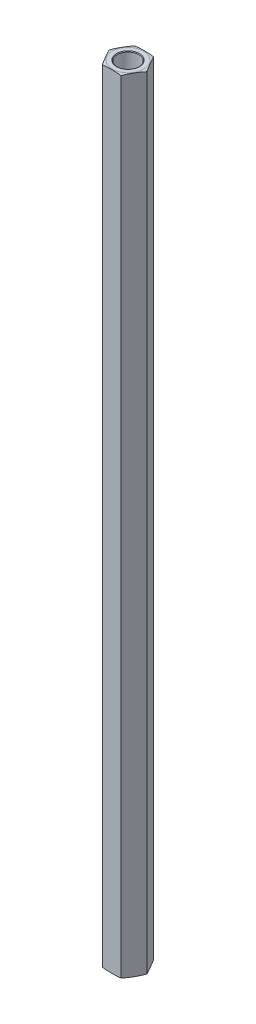
ISO-10303-21;
HEADER;
FILE_DESCRIPTION(('STEP AP214'),'2;1');
FILE_NAME('part.step','',(''),(''),'','','');
FILE_SCHEMA(('AUTOMOTIVE_DESIGN { 1 0 10303 214 1 1 1 1 }'));
ENDSEC;
DATA;
#1=APPLICATION_CONTEXT('core data for automotive mechanical design processes');
#2=APPLICATION_PROTOCOL_DEFINITION('international standard','automotive_design',2000,#1);
#3=PRODUCT_CONTEXT('',#1,'mechanical');
#4=PRODUCT('Part','Part','',(#3));
#5=PRODUCT_RELATED_PRODUCT_CATEGORY('part','',(#4));
#6=PRODUCT_DEFINITION_FORMATION('','',#4);
#7=PRODUCT_DEFINITION_CONTEXT('part definition',#1,'design');
#8=PRODUCT_DEFINITION('design','',#6,#7);
#9=PRODUCT_DEFINITION_SHAPE('','',#8);
#10=(LENGTH_UNIT() NAMED_UNIT(*) SI_UNIT(.MILLI.,.METRE.));
#11=(NAMED_UNIT(*) PLANE_ANGLE_UNIT() SI_UNIT($,.RADIAN.));
#12=(NAMED_UNIT(*) SI_UNIT($,.STERADIAN.) SOLID_ANGLE_UNIT());
#13=UNCERTAINTY_MEASURE_WITH_UNIT(LENGTH_MEASURE(1.E-05),#10,'distance_accuracy_value','');
#14=(GEOMETRIC_REPRESENTATION_CONTEXT(3) GLOBAL_UNCERTAINTY_ASSIGNED_CONTEXT((#13)) GLOBAL_UNIT_ASSIGNED_CONTEXT((#10,
#11,#12)) REPRESENTATION_CONTEXT('',''));
#15=CARTESIAN_POINT('',(0.,0.,0.));
#16=DIRECTION('',(0.,0.,1.));
#17=DIRECTION('',(1.,0.,0.));
#18=AXIS2_PLACEMENT_3D('',#15,#16,#17);
#19=CARTESIAN_POINT('',(0.,63.5,0.));
#20=DIRECTION('',(0.,1.,0.));
#21=DIRECTION('',(0.,0.,1.));
#22=AXIS2_PLACEMENT_3D('',#19,#20,#21);
#23=PLANE('',#22);
#24=CARTESIAN_POINT('',(0.,63.5,0.));
#25=DIRECTION('',(0.,1.,0.));
#26=DIRECTION('',(0.,0.,1.));
#27=AXIS2_PLACEMENT_3D('',#24,#25,#26);
#28=CIRCLE('',#27,2.0955);
#29=CARTESIAN_POINT('',(0.,63.5,2.0955));
#30=VERTEX_POINT('',#29);
#31=EDGE_CURVE('E302',#30,#30,#28,.T.);
#32=ORIENTED_EDGE('',*,*,#31,.T.);
#33=EDGE_LOOP('',(#32));
#34=FACE_BOUND('',#33,.T.);
#35=ADVANCED_FACE('F16',(#34),#23,.T.);
#36=CARTESIAN_POINT('',(0.,-63.5,0.));
#37=DIRECTION('',(0.,-1.,0.));
#38=DIRECTION('',(0.,0.,-1.));
#39=AXIS2_PLACEMENT_3D('',#36,#37,#38);
#40=PLANE('',#39);
#41=CARTESIAN_POINT('',(0.,-63.5,0.));
#42=DIRECTION('',(0.,-1.,0.));
#43=DIRECTION('',(0.,0.,-1.));
#44=AXIS2_PLACEMENT_3D('',#41,#42,#43);
#45=CIRCLE('',#44,2.0955);
#46=CARTESIAN_POINT('',(0.,-63.5,-2.0955));
#47=VERTEX_POINT('',#46);
#48=EDGE_CURVE('E312',#47,#47,#45,.T.);
#49=ORIENTED_EDGE('',*,*,#48,.T.);
#50=EDGE_LOOP('',(#49));
#51=FACE_BOUND('',#50,.T.);
#52=ADVANCED_FACE('F413',(#51),#40,.T.);
#53=CARTESIAN_POINT('',(0.,63.5,0.));
#54=DIRECTION('',(0.,1.,0.));
#55=DIRECTION('',(0.,0.,1.));
#56=AXIS2_PLACEMENT_3D('',#53,#54,#55);
#57=CYLINDRICAL_SURFACE('',#56,2.0955);
#58=CARTESIAN_POINT('',(0.,76.0729999999512,0.));
#59=DIRECTION('',(0.,1.,0.));
#60=DIRECTION('',(0.,0.,1.));
#61=AXIS2_PLACEMENT_3D('',#58,#59,#60);
#62=CIRCLE('',#61,2.09549999993897);
#63=CARTESIAN_POINT('',(0.,76.0729999999512,2.09549999993897));
#64=VERTEX_POINT('',#63);
#65=EDGE_CURVE('E314',#64,#64,#62,.T.);
#66=ORIENTED_EDGE('',*,*,#65,.T.);
#67=EDGE_LOOP('',(#66));
#68=FACE_BOUND('',#67,.T.);
#69=ORIENTED_EDGE('',*,*,#31,.F.);
#70=EDGE_LOOP('',(#69));
#71=FACE_BOUND('',#70,.T.);
#72=ADVANCED_FACE('F324',(#68,#71),#57,.F.);
#73=CARTESIAN_POINT('',(0.,-63.5,0.));
#74=DIRECTION('',(0.,-1.,0.));
#75=DIRECTION('',(0.,0.,-1.));
#76=AXIS2_PLACEMENT_3D('',#73,#74,#75);
#77=CYLINDRICAL_SURFACE('',#76,2.0955);
#78=ORIENTED_EDGE('',*,*,#48,.F.);
#79=EDGE_LOOP('',(#78));
#80=FACE_BOUND('',#79,.T.);
#81=CARTESIAN_POINT('',(0.,-76.0729999999512,0.));
#82=DIRECTION('',(0.,-1.,0.));
#83=DIRECTION('',(0.,0.,-1.));
#84=AXIS2_PLACEMENT_3D('',#81,#82,#83);
#85=CIRCLE('',#84,2.09550000005265);
#86=CARTESIAN_POINT('',(0.,-76.0729999999512,-2.09550000005265));
#87=VERTEX_POINT('',#86);
#88=EDGE_CURVE('E154',#87,#87,#85,.T.);
#89=ORIENTED_EDGE('',*,*,#88,.T.);
#90=EDGE_LOOP('',(#89));
#91=FACE_BOUND('',#90,.T.);
#92=ADVANCED_FACE('F329',(#80,#91),#77,.F.);
#93=CARTESIAN_POINT('',(0.,76.1999999999716,0.));
#94=DIRECTION('',(0.,1.,0.));
#95=DIRECTION('',(0.,0.,1.));
#96=AXIS2_PLACEMENT_3D('',#93,#94,#95);
#97=CONICAL_SURFACE('',#96,2.22249999995938,0.785398163397448);
#98=CARTESIAN_POINT('',(0.,76.2000000000285,0.));
#99=DIRECTION('',(0.,1.,0.));
#100=DIRECTION('',(0.,0.,1.));
#101=AXIS2_PLACEMENT_3D('',#98,#99,#100);
#102=CIRCLE('',#101,2.22250000001623);
#103=CARTESIAN_POINT('',(0.,76.2000000000285,2.22250000001623));
#104=VERTEX_POINT('',#103);
#105=EDGE_CURVE('E79',#104,#104,#102,.T.);
#106=ORIENTED_EDGE('',*,*,#105,.T.);
#107=EDGE_LOOP('',(#106));
#108=FACE_BOUND('',#107,.T.);
#109=ORIENTED_EDGE('',*,*,#65,.F.);
#110=EDGE_LOOP('',(#109));
#111=FACE_BOUND('',#110,.T.);
#112=ADVANCED_FACE('F327',(#108,#111),#97,.F.);
#113=CARTESIAN_POINT('',(-3.66617420935413,76.2,0.));
#114=DIRECTION('',(0.866025403784439,0.,-0.499999999999999));
#115=DIRECTION('',(-0.499999999999999,0.,-0.866025403784439));
#116=AXIS2_PLACEMENT_3D('',#113,#114,#115);
#117=PLANE('',#116);
#118=DIRECTION('',(0.,1.,0.));
#119=VECTOR('',#118,1.);
#120=CARTESIAN_POINT('',(-1.83308710467708,76.2,3.175));
#121=LINE('',#120,#119);
#122=CARTESIAN_POINT('',(-1.83308710467708,-76.073,3.17499999999999));
#123=VERTEX_POINT('',#122);
#124=CARTESIAN_POINT('',(-1.83308710467706,76.073,3.175));
#125=VERTEX_POINT('',#124);
#126=EDGE_CURVE('E75',#123,#125,#121,.T.);
#127=ORIENTED_EDGE('',*,*,#126,.T.);
#128=CARTESIAN_POINT('',(-3.66617420935412,76.073,0.));
#129=CARTESIAN_POINT('',(-3.62797961467393,76.0889014148997,0.0661549785605975));
#130=CARTESIAN_POINT('',(-3.58956810864153,76.1024886076105,0.132685658603946));
#131=CARTESIAN_POINT('',(-3.51249051795704,76.1258161979402,0.266187961794493));
#132=CARTESIAN_POINT('',(-3.47382473049837,76.1355604771397,0.333159070187556));
#133=CARTESIAN_POINT('',(-3.3964163186786,76.1519966530451,0.467234372392611));
#134=CARTESIAN_POINT('',(-3.35767399633298,76.1586945328669,0.534338043098447));
#135=CARTESIAN_POINT('',(-3.28009834620095,76.1697767572932,0.668703010557309));
#136=CARTESIAN_POINT('',(-3.24126499587751,76.1741604504739,0.735964346345629));
#137=CARTESIAN_POINT('',(-3.16354065964291,76.1812403004263,0.870586845688525));
#138=CARTESIAN_POINT('',(-3.1246496537445,76.1839355237591,0.937948043862028));
#139=CARTESIAN_POINT('',(-3.04685144594563,76.1881531983713,1.07269849250747));
#140=CARTESIAN_POINT('',(-3.00794424351938,76.1896756080272,1.14008774389011));
#141=CARTESIAN_POINT('',(-2.93051517598838,76.191922705889,1.27419882283648));
#142=CARTESIAN_POINT('',(-2.89199336248897,76.1926552468181,1.34092056101714));
#143=CARTESIAN_POINT('',(-2.81494778346103,76.1935767302574,1.47436741839211));
#144=CARTESIAN_POINT('',(-2.77642401791397,76.1937656658949,1.54109253761849));
#145=CARTESIAN_POINT('',(-2.69935964430966,76.1936659966805,1.67457194815462));
#146=CARTESIAN_POINT('',(-2.66081903631773,76.1933771811765,1.74132623935123));
#147=CARTESIAN_POINT('',(-2.58373908085278,76.192221986219,1.87483263846168));
#148=CARTESIAN_POINT('',(-2.54519973341192,76.1913555970385,1.9415847463198));
#149=CARTESIAN_POINT('',(-2.46812969629714,76.1887861940656,2.07507396634382));
#150=CARTESIAN_POINT('',(-2.42959900625906,76.1870832271616,2.14181107914046));
#151=CARTESIAN_POINT('',(-2.35255651340846,76.1824387229725,2.27525259109946));
#152=CARTESIAN_POINT('',(-2.31404470975378,76.1794972471357,2.34195699172048));
#153=CARTESIAN_POINT('',(-2.25084206239882,76.1732174124748,2.45142718811213));
#154=CARTESIAN_POINT('',(-2.22613849336951,76.1703980110462,2.49421502479918));
#155=CARTESIAN_POINT('',(-2.17676945272177,76.1638696794303,2.57972471152201));
#156=CARTESIAN_POINT('',(-2.15210397034136,76.1601610809138,2.62244658019807));
#157=CARTESIAN_POINT('',(-2.10282753811656,76.1516802711496,2.70779586442715));
#158=CARTESIAN_POINT('',(-2.07821657107493,76.1469084657008,2.75042330976666));
#159=CARTESIAN_POINT('',(-2.02900094683521,76.1360987712515,2.83566727147607));
#160=CARTESIAN_POINT('',(-2.00439646085438,76.1300577313084,2.87828349128898));
#161=CARTESIAN_POINT('',(-1.95527325900916,76.1165138354161,2.96336737271537));
#162=CARTESIAN_POINT('',(-1.930754596176,76.1090101978029,3.00583494247605));
#163=CARTESIAN_POINT('',(-1.88182157373165,76.0923203507084,3.09058942351758));
#164=CARTESIAN_POINT('',(-1.85740744053267,76.0831314978033,3.13287594264096));
#165=CARTESIAN_POINT('',(-1.83308710467707,76.073,3.175));
#166=B_SPLINE_CURVE_WITH_KNOTS('',3,(#128,#129,#130,#131,#132,#133,#134,#135,#136,#137,#138,
#139,#140,#141,#142,#143,#144,#145,#146,#147,#148,#149,#150,#151,#152,#153,#154,#155,#156,#157,
#158,#159,#160,#161,#162,#163,#164,#165),.UNSPECIFIED.,.F.,.F.,(4,2,2,2,2,2,2,2,2,2,2,2,2,2,2,2,
2,2,4),(0.,0.233977307818051,0.467717675040913,0.700996973557829,0.934341903230191,
1.16781571967295,1.40129782179891,1.63243665809747,1.86357841666705,2.09482211846393,
2.32606971471605,2.55730435147518,2.78852751694545,2.93698369265197,3.08538458004561,
3.2337289233465,3.38244598546656,3.53124274626105,3.68027493713584),.UNSPECIFIED.);
#167=CARTESIAN_POINT('',(-3.66617420935413,76.073,0.));
#168=VERTEX_POINT('',#167);
#169=EDGE_CURVE('E68',#168,#125,#166,.T.);
#170=ORIENTED_EDGE('',*,*,#169,.F.);
#171=DIRECTION('',(0.,1.,0.));
#172=VECTOR('',#171,1.);
#173=CARTESIAN_POINT('',(-3.66617420935413,76.2,0.));
#174=LINE('',#173,#172);
#175=CARTESIAN_POINT('',(-3.66617420935413,-76.073,0.));
#176=VERTEX_POINT('',#175);
#177=EDGE_CURVE('E72',#168,#176,#174,.F.);
#178=ORIENTED_EDGE('',*,*,#177,.T.);
#179=CARTESIAN_POINT('',(-1.83308710467708,-76.073,3.17499999999999));
#180=CARTESIAN_POINT('',(-1.87128169935727,-76.0889014148997,3.1088450214394));
#181=CARTESIAN_POINT('',(-1.90969320538966,-76.1024886076105,3.04231434139605));
#182=CARTESIAN_POINT('',(-1.98677079607416,-76.1258161979402,2.9088120382055));
#183=CARTESIAN_POINT('',(-2.02543658353282,-76.1355604771397,2.84184092981244));
#184=CARTESIAN_POINT('',(-2.10284499535259,-76.1519966530451,2.70776562760738));
#185=CARTESIAN_POINT('',(-2.14158731769822,-76.1586945328669,2.64066195690155));
#186=CARTESIAN_POINT('',(-2.21916296783025,-76.1697767572932,2.50629698944268));
#187=CARTESIAN_POINT('',(-2.25799631815369,-76.1741604504739,2.43903565365436));
#188=CARTESIAN_POINT('',(-2.33572065438829,-76.1812403004263,2.30441315431147));
#189=CARTESIAN_POINT('',(-2.37461166028669,-76.1839355237591,2.23705195613796));
#190=CARTESIAN_POINT('',(-2.45240986808556,-76.1881531983713,2.10230150749252));
#191=CARTESIAN_POINT('',(-2.49131707051182,-76.1896756080272,2.03491225610988));
#192=CARTESIAN_POINT('',(-2.56874613804282,-76.191922705889,1.90080117716351));
#193=CARTESIAN_POINT('',(-2.60726795154222,-76.1926552468181,1.83407943898285));
#194=CARTESIAN_POINT('',(-2.68431353057017,-76.1935767302574,1.70063258160788));
#195=CARTESIAN_POINT('',(-2.72283729611723,-76.1937656658949,1.6339074623815));
#196=CARTESIAN_POINT('',(-2.79990166972153,-76.1936659966805,1.50042805184538));
#197=CARTESIAN_POINT('',(-2.83844227771346,-76.1933771811765,1.43367376064876));
#198=CARTESIAN_POINT('',(-2.91552223317841,-76.192221986219,1.30016736153832));
#199=CARTESIAN_POINT('',(-2.95406158061928,-76.1913555970385,1.23341525368019));
#200=CARTESIAN_POINT('',(-3.03113161773406,-76.1887861940656,1.09992603365617));
#201=CARTESIAN_POINT('',(-3.06966230777213,-76.1870832271616,1.03318892085954));
#202=CARTESIAN_POINT('',(-3.14670480062273,-76.1824387229725,0.899747408900532));
#203=CARTESIAN_POINT('',(-3.18521660427741,-76.1794972471357,0.833043008279515));
#204=CARTESIAN_POINT('',(-3.24841925163237,-76.1732174124748,0.723572811887864));
#205=CARTESIAN_POINT('',(-3.27312282066168,-76.1703980110462,0.680784975200813));
#206=CARTESIAN_POINT('',(-3.32249186130943,-76.1638696794303,0.595275288477983));
#207=CARTESIAN_POINT('',(-3.34715734368984,-76.1601610809138,0.552553419801923));
#208=CARTESIAN_POINT('',(-3.39643377591464,-76.1516802711496,0.467204135572843));
#209=CARTESIAN_POINT('',(-3.42104474295627,-76.1469084657008,0.424576690233332));
#210=CARTESIAN_POINT('',(-3.47026036719599,-76.1360987712515,0.33933272852392));
#211=CARTESIAN_POINT('',(-3.49486485317681,-76.1300577313083,0.296716508711013));
#212=CARTESIAN_POINT('',(-3.54398805502204,-76.1165138354161,0.211632627284621));
#213=CARTESIAN_POINT('',(-3.5685067178552,-76.1090101978029,0.169165057523944));
#214=CARTESIAN_POINT('',(-3.61743974029955,-76.0923203507084,0.0844105764824117));
#215=CARTESIAN_POINT('',(-3.64185387349853,-76.0831314978033,0.042124057359026));
#216=CARTESIAN_POINT('',(-3.66617420935413,-76.073,0.));
#217=B_SPLINE_CURVE_WITH_KNOTS('',3,(#179,#180,#181,#182,#183,#184,#185,#186,#187,#188,#189,
#190,#191,#192,#193,#194,#195,#196,#197,#198,#199,#200,#201,#202,#203,#204,#205,#206,#207,#208,
#209,#210,#211,#212,#213,#214,#215,#216),.UNSPECIFIED.,.F.,.F.,(4,2,2,2,2,2,2,2,2,2,2,2,2,2,2,2,
2,2,4),(0.,0.233977307818054,0.467717675040914,0.70099697355783,0.934341903230193,
1.16781571967295,1.40129782179891,1.63243665809747,1.86357841666705,2.09482211846393,
2.32606971471605,2.55730435147519,2.78852751694545,2.93698369265197,3.08538458004561,
3.2337289233465,3.38244598546656,3.53124274626106,3.68027493713584),.UNSPECIFIED.);
#218=EDGE_CURVE('E87',#123,#176,#217,.T.);
#219=ORIENTED_EDGE('',*,*,#218,.F.);
#220=EDGE_LOOP('',(#127,#170,#178,#219));
#221=FACE_BOUND('',#220,.T.);
#222=ADVANCED_FACE('F70',(#221),#117,.F.);
#223=CARTESIAN_POINT('',(0.,-76.1999999998579,0.));
#224=DIRECTION('',(0.,-1.,0.));
#225=DIRECTION('',(0.,0.,-1.));
#226=AXIS2_PLACEMENT_3D('',#223,#224,#225);
#227=CONICAL_SURFACE('',#226,2.22249999995938,0.785398163397448);
#228=ORIENTED_EDGE('',*,*,#88,.F.);
#229=EDGE_LOOP('',(#228));
#230=FACE_BOUND('',#229,.T.);
#231=CARTESIAN_POINT('',(0.,-76.1999999999716,0.));
#232=DIRECTION('',(0.,-1.,0.));
#233=DIRECTION('',(0.,0.,-1.));
#234=AXIS2_PLACEMENT_3D('',#231,#232,#233);
#235=CIRCLE('',#234,2.22250000007307);
#236=CARTESIAN_POINT('',(0.,-76.1999999999716,-2.22250000007307));
#237=VERTEX_POINT('',#236);
#238=EDGE_CURVE('E278',#237,#237,#235,.F.);
#239=ORIENTED_EDGE('',*,*,#238,.F.);
#240=EDGE_LOOP('',(#239));
#241=FACE_BOUND('',#240,.T.);
#242=ADVANCED_FACE('F336',(#230,#241),#227,.F.);
#243=CARTESIAN_POINT('',(-1.83308710467707,76.2,-3.175));
#244=DIRECTION('',(0.,-1.,0.));
#245=DIRECTION('',(0.,0.,-1.));
#246=AXIS2_PLACEMENT_3D('',#243,#244,#245);
#247=PLANE('',#246);
#248=CARTESIAN_POINT('',(0.,76.2,0.));
#249=DIRECTION('',(0.,-1.,0.));
#250=DIRECTION('',(0.,0.,1.));
#251=AXIS2_PLACEMENT_3D('',#248,#249,#250);
#252=CIRCLE('',#251,3.03117420935412);
#253=CARTESIAN_POINT('',(0.,76.2,3.03117420935411));
#254=VERTEX_POINT('',#253);
#255=CARTESIAN_POINT('',(0.,76.2,-3.03117420935411));
#256=VERTEX_POINT('',#255);
#257=EDGE_CURVE('E78',#254,#256,#252,.T.);
#258=ORIENTED_EDGE('',*,*,#257,.F.);
#259=CARTESIAN_POINT('',(0.,76.2,0.));
#260=DIRECTION('',(0.,-1.,0.));
#261=DIRECTION('',(0.,0.,-1.));
#262=AXIS2_PLACEMENT_3D('',#259,#260,#261);
#263=CIRCLE('',#262,3.03117420935412);
#264=EDGE_CURVE('E139',#256,#254,#263,.T.);
#265=ORIENTED_EDGE('',*,*,#264,.F.);
#266=EDGE_LOOP('',(#258,#265));
#267=FACE_BOUND('',#266,.T.);
#268=ORIENTED_EDGE('',*,*,#105,.F.);
#269=EDGE_LOOP('',(#268));
#270=FACE_BOUND('',#269,.T.);
#271=ADVANCED_FACE('F115',(#267,#270),#247,.F.);
#272=CARTESIAN_POINT('',(-1.83308710467707,76.2,-3.175));
#273=DIRECTION('',(0.866025403784439,0.,0.5));
#274=DIRECTION('',(0.5,0.,-0.866025403784439));
#275=AXIS2_PLACEMENT_3D('',#272,#273,#274);
#276=PLANE('',#275);
#277=ORIENTED_EDGE('',*,*,#177,.F.);
#278=CARTESIAN_POINT('',(-1.83308710467706,76.073,-3.17500000000001));
#279=CARTESIAN_POINT('',(-1.87128169935725,76.0889014148997,-3.10884502143942));
#280=CARTESIAN_POINT('',(-1.90969320538965,76.1024886076105,-3.04231434139607));
#281=CARTESIAN_POINT('',(-1.98677079607414,76.1258161979402,-2.90881203820553));
#282=CARTESIAN_POINT('',(-2.0254365835328,76.1355604771397,-2.84184092981247));
#283=CARTESIAN_POINT('',(-2.10284499535257,76.1519966530451,-2.70776562760742));
#284=CARTESIAN_POINT('',(-2.1415873176982,76.1586945328669,-2.64066195690159));
#285=CARTESIAN_POINT('',(-2.21916296783022,76.1697767572932,-2.50629698944273));
#286=CARTESIAN_POINT('',(-2.25799631815366,76.1741604504739,-2.43903565365441));
#287=CARTESIAN_POINT('',(-2.33572065438826,76.1812403004263,-2.30441315431152));
#288=CARTESIAN_POINT('',(-2.37461166028667,76.1839355237591,-2.23705195613802));
#289=CARTESIAN_POINT('',(-2.45240986808553,76.1881531983713,-2.10230150749258));
#290=CARTESIAN_POINT('',(-2.49131707051179,76.1896756080272,-2.03491225610994));
#291=CARTESIAN_POINT('',(-2.56874613804278,76.191922705889,-1.90080117716357));
#292=CARTESIAN_POINT('',(-2.60726795154219,76.1926552468181,-1.83407943898291));
#293=CARTESIAN_POINT('',(-2.68431353057013,76.1935767302574,-1.70063258160795));
#294=CARTESIAN_POINT('',(-2.72283729611719,76.1937656658949,-1.63390746238157));
#295=CARTESIAN_POINT('',(-2.79990166972149,76.1936659966805,-1.50042805184545));
#296=CARTESIAN_POINT('',(-2.83844227771342,76.1933771811765,-1.43367376064884));
#297=CARTESIAN_POINT('',(-2.91552223317837,76.192221986219,-1.3001673615384));
#298=CARTESIAN_POINT('',(-2.95406158061923,76.1913555970385,-1.23341525368027));
#299=CARTESIAN_POINT('',(-3.03113161773401,76.1887861940656,-1.09992603365625));
#300=CARTESIAN_POINT('',(-3.06966230777209,76.1870832271616,-1.03318892085962));
#301=CARTESIAN_POINT('',(-3.14670480062269,76.1824387229725,-0.899747408900623));
#302=CARTESIAN_POINT('',(-3.18521660427736,76.1794972471357,-0.833043008279609));
#303=CARTESIAN_POINT('',(-3.24841925163232,76.1732174124748,-0.723572811887956));
#304=CARTESIAN_POINT('',(-3.27312282066164,76.1703980110462,-0.6807849752009));
#305=CARTESIAN_POINT('',(-3.32249186130939,76.1638696794303,-0.595275288478059));
#306=CARTESIAN_POINT('',(-3.3471573436898,76.1601610809138,-0.552553419801995));
#307=CARTESIAN_POINT('',(-3.39643377591461,76.1516802711496,-0.467204135572906));
#308=CARTESIAN_POINT('',(-3.42104474295624,76.1469084657008,-0.424576690233391));
#309=CARTESIAN_POINT('',(-3.47026036719597,76.1360987712515,-0.339332728523969));
#310=CARTESIAN_POINT('',(-3.49486485317679,76.1300577313084,-0.296716508711057));
#311=CARTESIAN_POINT('',(-3.54398805502203,76.1165138354161,-0.211632627284654));
#312=CARTESIAN_POINT('',(-3.56850671785518,76.1090101978029,-0.169165057523973));
#313=CARTESIAN_POINT('',(-3.61743974029955,76.0923203507084,-0.084410576482432));
#314=CARTESIAN_POINT('',(-3.64185387349853,76.0831314978033,-0.0421240573590423));
#315=CARTESIAN_POINT('',(-3.66617420935413,76.073,0.));
#316=B_SPLINE_CURVE_WITH_KNOTS('',3,(#278,#279,#280,#281,#282,#283,#284,#285,#286,#287,#288,
#289,#290,#291,#292,#293,#294,#295,#296,#297,#298,#299,#300,#301,#302,#303,#304,#305,#306,#307,
#308,#309,#310,#311,#312,#313,#314,#315),.UNSPECIFIED.,.F.,.F.,(4,2,2,2,2,2,2,2,2,2,2,2,2,2,2,2,
2,2,4),(0.,0.233977307818047,0.4677176750409,0.700996973557809,0.934341903230164,
1.16781571967292,1.40129782179887,1.63243665809742,1.863578416667,2.09482211846387,
2.32606971471598,2.55730435147511,2.78852751694536,2.9369836926519,3.08538458004556,
3.23372892334647,3.38244598546655,3.53124274626106,3.68027493713586),.UNSPECIFIED.);
#317=CARTESIAN_POINT('',(-1.83308710467705,76.073,-3.17500000000001));
#318=VERTEX_POINT('',#317);
#319=EDGE_CURVE('E84',#318,#168,#316,.T.);
#320=ORIENTED_EDGE('',*,*,#319,.F.);
#321=DIRECTION('',(0.,1.,0.));
#322=VECTOR('',#321,1.);
#323=CARTESIAN_POINT('',(-1.83308710467705,76.2,-3.175));
#324=LINE('',#323,#322);
#325=CARTESIAN_POINT('',(-1.83308710467708,-76.073,-3.175));
#326=VERTEX_POINT('',#325);
#327=EDGE_CURVE('E177',#318,#326,#324,.F.);
#328=ORIENTED_EDGE('',*,*,#327,.T.);
#329=CARTESIAN_POINT('',(-3.66617420935413,-76.073,0.));
#330=CARTESIAN_POINT('',(-3.62797961467394,-76.0889014148997,-0.0661549785605842));
#331=CARTESIAN_POINT('',(-3.58956810864155,-76.1024886076105,-0.132685658603931));
#332=CARTESIAN_POINT('',(-3.51249051795705,-76.1258161979402,-0.266187961794475));
#333=CARTESIAN_POINT('',(-3.47382473049839,-76.1355604771397,-0.333159070187536));
#334=CARTESIAN_POINT('',(-3.39641631867862,-76.1519966530451,-0.467234372392588));
#335=CARTESIAN_POINT('',(-3.357673996333,-76.1586945328669,-0.534338043098422));
#336=CARTESIAN_POINT('',(-3.28009834620097,-76.1697767572932,-0.668703010557281));
#337=CARTESIAN_POINT('',(-3.24126499587753,-76.1741604504739,-0.735964346345599));
#338=CARTESIAN_POINT('',(-3.16354065964293,-76.1812403004263,-0.870586845688492));
#339=CARTESIAN_POINT('',(-3.12464965374452,-76.1839355237591,-0.937948043861994));
#340=CARTESIAN_POINT('',(-3.04685144594566,-76.1881531983713,-1.07269849250743));
#341=CARTESIAN_POINT('',(-3.0079442435194,-76.1896756080272,-1.14008774389007));
#342=CARTESIAN_POINT('',(-2.93051517598841,-76.191922705889,-1.27419882283644));
#343=CARTESIAN_POINT('',(-2.891993362489,-76.1926552468181,-1.3409205610171));
#344=CARTESIAN_POINT('',(-2.81494778346106,-76.1935767302574,-1.47436741839206));
#345=CARTESIAN_POINT('',(-2.776424017914,-76.1937656658949,-1.54109253761844));
#346=CARTESIAN_POINT('',(-2.6993596443097,-76.1936659966805,-1.67457194815457));
#347=CARTESIAN_POINT('',(-2.66081903631777,-76.1933771811765,-1.74132623935118));
#348=CARTESIAN_POINT('',(-2.58373908085282,-76.192221986219,-1.87483263846162));
#349=CARTESIAN_POINT('',(-2.54519973341195,-76.1913555970385,-1.94158474631974));
#350=CARTESIAN_POINT('',(-2.46812969629717,-76.1887861940656,-2.07507396634376));
#351=CARTESIAN_POINT('',(-2.4295990062591,-76.1870832271616,-2.14181107914039));
#352=CARTESIAN_POINT('',(-2.3525565134085,-76.1824387229725,-2.27525259109939));
#353=CARTESIAN_POINT('',(-2.31404470975383,-76.1794972471357,-2.34195699172041));
#354=CARTESIAN_POINT('',(-2.25084206239887,-76.1732174124748,-2.45142718811206));
#355=CARTESIAN_POINT('',(-2.22613849336955,-76.1703980110462,-2.49421502479912));
#356=CARTESIAN_POINT('',(-2.1767694527218,-76.1638696794303,-2.57972471152195));
#357=CARTESIAN_POINT('',(-2.15210397034139,-76.1601610809138,-2.62244658019802));
#358=CARTESIAN_POINT('',(-2.10282753811659,-76.1516802711496,-2.7077958644271));
#359=CARTESIAN_POINT('',(-2.07821657107495,-76.1469084657008,-2.75042330976661));
#360=CARTESIAN_POINT('',(-2.02900094683523,-76.1360987712515,-2.83566727147603));
#361=CARTESIAN_POINT('',(-2.0043964608544,-76.1300577313084,-2.87828349128894));
#362=CARTESIAN_POINT('',(-1.95527325900917,-76.1165138354161,-2.96336737271534));
#363=CARTESIAN_POINT('',(-1.93075459617602,-76.1090101978029,-3.00583494247602));
#364=CARTESIAN_POINT('',(-1.88182157373166,-76.0923203507084,-3.09058942351756));
#365=CARTESIAN_POINT('',(-1.85740744053268,-76.0831314978033,-3.13287594264095));
#366=CARTESIAN_POINT('',(-1.83308710467707,-76.073,-3.17499999999999));
#367=B_SPLINE_CURVE_WITH_KNOTS('',3,(#329,#330,#331,#332,#333,#334,#335,#336,#337,#338,#339,
#340,#341,#342,#343,#344,#345,#346,#347,#348,#349,#350,#351,#352,#353,#354,#355,#356,#357,#358,
#359,#360,#361,#362,#363,#364,#365,#366),.UNSPECIFIED.,.F.,.F.,(4,2,2,2,2,2,2,2,2,2,2,2,2,2,2,2,
2,2,4),(0.,0.233977307818045,0.467717675040901,0.700996973557812,0.934341903230169,
1.16781571967292,1.40129782179888,1.63243665809743,1.86357841666701,2.09482211846388,
2.32606971471599,2.55730435147512,2.78852751694538,2.93698369265191,3.08538458004557,
3.23372892334647,3.38244598546654,3.53124274626104,3.68027493713584),.UNSPECIFIED.);
#368=EDGE_CURVE('E86',#176,#326,#367,.T.);
#369=ORIENTED_EDGE('',*,*,#368,.F.);
#370=EDGE_LOOP('',(#277,#320,#328,#369));
#371=FACE_BOUND('',#370,.T.);
#372=ADVANCED_FACE('F82',(#371),#276,.F.);
#373=CARTESIAN_POINT('',(-1.83308710467707,76.2,3.175));
#374=DIRECTION('',(0.,0.,-1.));
#375=DIRECTION('',(-1.,0.,0.));
#376=AXIS2_PLACEMENT_3D('',#373,#374,#375);
#377=PLANE('',#376);
#378=DIRECTION('',(0.,1.,0.));
#379=VECTOR('',#378,1.);
#380=CARTESIAN_POINT('',(1.83308710467706,76.2,3.17499999999999));
#381=LINE('',#380,#379);
#382=CARTESIAN_POINT('',(1.83308710467706,-76.073,3.17499999999999));
#383=VERTEX_POINT('',#382);
#384=CARTESIAN_POINT('',(1.83308710467706,76.073,3.17499999999999));
#385=VERTEX_POINT('',#384);
#386=EDGE_CURVE('E179',#383,#385,#381,.T.);
#387=ORIENTED_EDGE('',*,*,#386,.T.);
#388=CARTESIAN_POINT('',(-1.83308710467706,76.073,3.175));
#389=CARTESIAN_POINT('',(-1.73237579828683,76.0939400141518,3.175));
#390=CARTESIAN_POINT('',(-1.63096506893486,76.1108853495327,3.175));
#391=CARTESIAN_POINT('',(-1.42767146651469,76.1384971643984,3.175));
#392=CARTESIAN_POINT('',(-1.32579191427254,76.1491875658753,3.175));
#393=CARTESIAN_POINT('',(-1.12177634709138,76.1661280408079,3.175));
#394=CARTESIAN_POINT('',(-1.0196405664338,76.1723812707188,3.175));
#395=CARTESIAN_POINT('',(-0.815663681397375,76.1819028064183,3.175));
#396=CARTESIAN_POINT('',(-0.713823115514573,76.1851834044999,3.175));
#397=CARTESIAN_POINT('',(-0.510018485441651,76.1899454848703,3.175));
#398=CARTESIAN_POINT('',(-0.408054390577976,76.1914254100882,3.175));
#399=CARTESIAN_POINT('',(-0.20406020033787,76.1933146818379,3.175));
#400=CARTESIAN_POINT('',(-0.102030100168935,76.1937234241492,3.175));
#401=CARTESIAN_POINT('',(0.102030100168935,76.1937234241492,3.175));
#402=CARTESIAN_POINT('',(0.20406020033787,76.1933146818379,3.175));
#403=CARTESIAN_POINT('',(0.408054390577977,76.1914254100882,3.17499999999999));
#404=CARTESIAN_POINT('',(0.510018485441652,76.1899454848703,3.17499999999999));
#405=CARTESIAN_POINT('',(0.713823115514574,76.1851834044999,3.17499999999999));
#406=CARTESIAN_POINT('',(0.815663681397377,76.1819028064183,3.17499999999999));
#407=CARTESIAN_POINT('',(1.0196405664338,76.1723812707188,3.17499999999999));
#408=CARTESIAN_POINT('',(1.12177634709138,76.1661280408079,3.17499999999999));
#409=CARTESIAN_POINT('',(1.32579191427254,76.1491875658753,3.17499999999999));
#410=CARTESIAN_POINT('',(1.42767146651469,76.1384971643984,3.17499999999999));
#411=CARTESIAN_POINT('',(1.63096506893486,76.1108853495327,3.17499999999999));
#412=CARTESIAN_POINT('',(1.73237579828684,76.0939400141518,3.17499999999999));
#413=CARTESIAN_POINT('',(1.83308710467706,76.073,3.17499999999999));
#414=B_SPLINE_CURVE_WITH_KNOTS('',3,(#388,#389,#390,#391,#392,#393,#394,#395,#396,#397,#398,
#399,#400,#401,#402,#403,#404,#405,#406,#407,#408,#409,#410,#411,#412,#413),.UNSPECIFIED.,.F.,
.F.,(4,2,2,2,2,2,2,2,2,2,2,2,4),(0.,0.308333242342805,0.615479423308232,0.922406891130007,
1.2280592962085,1.53397581645216,1.84006485747889,2.14615389850561,2.45207041874927,
2.75772282382777,3.06465029164954,3.37179647261497,3.68012971495778),.UNSPECIFIED.);
#415=EDGE_CURVE('E273',#125,#385,#414,.T.);
#416=ORIENTED_EDGE('',*,*,#415,.F.);
#417=ORIENTED_EDGE('',*,*,#126,.F.);
#418=CARTESIAN_POINT('',(1.83308710467706,-76.073,3.17499999999999));
#419=CARTESIAN_POINT('',(1.73237579828684,-76.0939400141518,3.17499999999999));
#420=CARTESIAN_POINT('',(1.63096506893486,-76.1108853495327,3.17499999999999));
#421=CARTESIAN_POINT('',(1.4276714665147,-76.1384971643984,3.17499999999999));
#422=CARTESIAN_POINT('',(1.32579191427254,-76.1491875658753,3.17499999999999));
#423=CARTESIAN_POINT('',(1.12177634709138,-76.1661280408079,3.17499999999999));
#424=CARTESIAN_POINT('',(1.0196405664338,-76.1723812707188,3.17499999999999));
#425=CARTESIAN_POINT('',(0.815663681397376,-76.1819028064183,3.17499999999999));
#426=CARTESIAN_POINT('',(0.713823115514574,-76.1851834044999,3.17499999999999));
#427=CARTESIAN_POINT('',(0.510018485441651,-76.1899454848703,3.17499999999999));
#428=CARTESIAN_POINT('',(0.408054390577975,-76.1914254100882,3.175));
#429=CARTESIAN_POINT('',(0.204060200337868,-76.1933146818379,3.17499999999999));
#430=CARTESIAN_POINT('',(0.102030100168933,-76.1937234241492,3.17499999999999));
#431=CARTESIAN_POINT('',(-0.102030100168939,-76.1937234241492,3.17499999999999));
#432=CARTESIAN_POINT('',(-0.204060200337874,-76.1933146818379,3.175));
#433=CARTESIAN_POINT('',(-0.408054390577982,-76.1914254100882,3.175));
#434=CARTESIAN_POINT('',(-0.510018485441658,-76.1899454848703,3.175));
#435=CARTESIAN_POINT('',(-0.713823115514581,-76.1851834044999,3.175));
#436=CARTESIAN_POINT('',(-0.815663681397385,-76.1819028064183,3.175));
#437=CARTESIAN_POINT('',(-1.01964056643381,-76.1723812707188,3.175));
#438=CARTESIAN_POINT('',(-1.12177634709139,-76.1661280408079,3.175));
#439=CARTESIAN_POINT('',(-1.32579191427255,-76.1491875658753,3.175));
#440=CARTESIAN_POINT('',(-1.42767146651471,-76.1384971643984,3.175));
#441=CARTESIAN_POINT('',(-1.63096506893487,-76.1108853495327,3.175));
#442=CARTESIAN_POINT('',(-1.73237579828685,-76.0939400141518,3.175));
#443=CARTESIAN_POINT('',(-1.83308710467708,-76.073,3.175));
#444=B_SPLINE_CURVE_WITH_KNOTS('',3,(#418,#419,#420,#421,#422,#423,#424,#425,#426,#427,#428,
#429,#430,#431,#432,#433,#434,#435,#436,#437,#438,#439,#440,#441,#442,#443),.UNSPECIFIED.,.F.,
.F.,(4,2,2,2,2,2,2,2,2,2,2,2,4),(0.,0.308333242342807,0.615479423308235,0.922406891130011,
1.2280592962085,1.53397581645217,1.84006485747889,2.14615389850562,2.45207041874929,
2.75772282382778,3.06465029164956,3.37179647261499,3.6801297149578),.UNSPECIFIED.);
#445=EDGE_CURVE('E250',#383,#123,#444,.T.);
#446=ORIENTED_EDGE('',*,*,#445,.F.);
#447=EDGE_LOOP('',(#387,#416,#417,#446));
#448=FACE_BOUND('',#447,.T.);
#449=ADVANCED_FACE('F203',(#448),#377,.F.);
#450=CARTESIAN_POINT('',(-1.83308710467707,-76.2,-3.175));
#451=DIRECTION('',(0.,-1.,0.));
#452=DIRECTION('',(0.,0.,-1.));
#453=AXIS2_PLACEMENT_3D('',#450,#451,#452);
#454=PLANE('',#453);
#455=CARTESIAN_POINT('',(0.,-76.2,0.));
#456=DIRECTION('',(0.,1.,0.));
#457=DIRECTION('',(0.,0.,1.));
#458=AXIS2_PLACEMENT_3D('',#455,#456,#457);
#459=CIRCLE('',#458,3.03117420935408);
#460=CARTESIAN_POINT('',(0.,-76.2,3.0311742093541));
#461=VERTEX_POINT('',#460);
#462=CARTESIAN_POINT('',(0.,-76.2,-3.0311742093541));
#463=VERTEX_POINT('',#462);
#464=EDGE_CURVE('E189',#461,#463,#459,.T.);
#465=ORIENTED_EDGE('',*,*,#464,.F.);
#466=CARTESIAN_POINT('',(0.,-76.2,0.));
#467=DIRECTION('',(0.,1.,0.));
#468=DIRECTION('',(0.,0.,-1.));
#469=AXIS2_PLACEMENT_3D('',#466,#467,#468);
#470=CIRCLE('',#469,3.03117420935408);
#471=EDGE_CURVE('E182',#461,#463,#470,.F.);
#472=ORIENTED_EDGE('',*,*,#471,.T.);
#473=EDGE_LOOP('',(#465,#472));
#474=FACE_BOUND('',#473,.T.);
#475=ORIENTED_EDGE('',*,*,#238,.T.);
#476=EDGE_LOOP('',(#475));
#477=FACE_BOUND('',#476,.T.);
#478=ADVANCED_FACE('F194',(#474,#477),#454,.T.);
#479=CARTESIAN_POINT('',(1.83308710467706,76.2,3.17499999999999));
#480=DIRECTION('',(-0.866025403784439,0.,-0.5));
#481=DIRECTION('',(-0.5,0.,0.866025403784439));
#482=AXIS2_PLACEMENT_3D('',#479,#480,#481);
#483=PLANE('',#482);
#484=DIRECTION('',(0.,1.,0.));
#485=VECTOR('',#484,1.);
#486=CARTESIAN_POINT('',(3.66617420935412,76.2,0.));
#487=LINE('',#486,#485);
#488=CARTESIAN_POINT('',(3.66617420935412,-76.073,0.));
#489=VERTEX_POINT('',#488);
#490=CARTESIAN_POINT('',(3.66617420935412,76.073,0.));
#491=VERTEX_POINT('',#490);
#492=EDGE_CURVE('E235',#489,#491,#487,.T.);
#493=ORIENTED_EDGE('',*,*,#492,.T.);
#494=CARTESIAN_POINT('',(1.83308710467706,76.073,3.17499999999999));
#495=CARTESIAN_POINT('',(1.87128169935726,76.0889014148997,3.1088450214394));
#496=CARTESIAN_POINT('',(1.90969320538965,76.1024886076105,3.04231434139605));
#497=CARTESIAN_POINT('',(1.98677079607415,76.1258161979402,2.9088120382055));
#498=CARTESIAN_POINT('',(2.02543658353281,76.1355604771397,2.84184092981244));
#499=CARTESIAN_POINT('',(2.10284499535258,76.1519966530451,2.70776562760738));
#500=CARTESIAN_POINT('',(2.14158731769821,76.1586945328669,2.64066195690155));
#501=CARTESIAN_POINT('',(2.21916296783024,76.1697767572932,2.50629698944269));
#502=CARTESIAN_POINT('',(2.25799631815368,76.1741604504739,2.43903565365437));
#503=CARTESIAN_POINT('',(2.33572065438828,76.1812403004263,2.30441315431147));
#504=CARTESIAN_POINT('',(2.37461166028669,76.1839355237591,2.23705195613797));
#505=CARTESIAN_POINT('',(2.45240986808556,76.1881531983714,2.10230150749252));
#506=CARTESIAN_POINT('',(2.49131707051181,76.1896756080272,2.03491225610988));
#507=CARTESIAN_POINT('',(2.56874613804281,76.191922705889,1.90080117716351));
#508=CARTESIAN_POINT('',(2.60726795154221,76.1926552468181,1.83407943898285));
#509=CARTESIAN_POINT('',(2.68431353057016,76.1935767302574,1.70063258160788));
#510=CARTESIAN_POINT('',(2.72283729611722,76.1937656658949,1.6339074623815));
#511=CARTESIAN_POINT('',(2.79990166972153,76.1936659966805,1.50042805184538));
#512=CARTESIAN_POINT('',(2.83844227771346,76.1933771811765,1.43367376064876));
#513=CARTESIAN_POINT('',(2.91552223317841,76.192221986219,1.30016736153832));
#514=CARTESIAN_POINT('',(2.95406158061927,76.1913555970385,1.23341525368019));
#515=CARTESIAN_POINT('',(3.03113161773405,76.1887861940656,1.09992603365617));
#516=CARTESIAN_POINT('',(3.06966230777213,76.1870832271616,1.03318892085954));
#517=CARTESIAN_POINT('',(3.14670480062273,76.1824387229725,0.899747408900531));
#518=CARTESIAN_POINT('',(3.18521660427741,76.1794972471357,0.833043008279514));
#519=CARTESIAN_POINT('',(3.24841925163237,76.1732174124748,0.723572811887865));
#520=CARTESIAN_POINT('',(3.27312282066168,76.1703980110462,0.680784975200815));
#521=CARTESIAN_POINT('',(3.32249186130942,76.1638696794303,0.595275288477986));
#522=CARTESIAN_POINT('',(3.34715734368983,76.1601610809138,0.552553419801928));
#523=CARTESIAN_POINT('',(3.39643377591463,76.1516802711496,0.467204135572849));
#524=CARTESIAN_POINT('',(3.42104474295626,76.1469084657008,0.424576690233339));
#525=CARTESIAN_POINT('',(3.47026036719598,76.1360987712515,0.339332728523928));
#526=CARTESIAN_POINT('',(3.49486485317681,76.1300577313084,0.296716508711022));
#527=CARTESIAN_POINT('',(3.54398805502203,76.1165138354161,0.211632627284631));
#528=CARTESIAN_POINT('',(3.56850671785519,76.1090101978029,0.169165057523955));
#529=CARTESIAN_POINT('',(3.61743974029954,76.0923203507084,0.0844105764824248));
#530=CARTESIAN_POINT('',(3.64185387349852,76.0831314978033,0.0421240573590407));
#531=CARTESIAN_POINT('',(3.66617420935412,76.073,0.));
#532=B_SPLINE_CURVE_WITH_KNOTS('',3,(#494,#495,#496,#497,#498,#499,#500,#501,#502,#503,#504,
#505,#506,#507,#508,#509,#510,#511,#512,#513,#514,#515,#516,#517,#518,#519,#520,#521,#522,#523,
#524,#525,#526,#527,#528,#529,#530,#531),.UNSPECIFIED.,.F.,.F.,(4,2,2,2,2,2,2,2,2,2,2,2,2,2,2,2,
2,2,4),(0.,0.233977307818054,0.467717675040915,0.700996973557832,0.934341903230195,
1.16781571967295,1.40129782179892,1.63243665809748,1.86357841666706,2.09482211846394,
2.32606971471605,2.55730435147519,2.78852751694545,2.93698369265197,3.08538458004561,
3.2337289233465,3.38244598546656,3.53124274626105,3.68027493713583),.UNSPECIFIED.);
#533=EDGE_CURVE('E268',#385,#491,#532,.T.);
#534=ORIENTED_EDGE('',*,*,#533,.F.);
#535=ORIENTED_EDGE('',*,*,#386,.F.);
#536=CARTESIAN_POINT('',(3.66617420935412,-76.073,0.));
#537=CARTESIAN_POINT('',(3.62797961467393,-76.0889014148997,0.0661549785605952));
#538=CARTESIAN_POINT('',(3.58956810864153,-76.1024886076105,0.132685658603945));
#539=CARTESIAN_POINT('',(3.51249051795703,-76.1258161979402,0.266187961794492));
#540=CARTESIAN_POINT('',(3.47382473049837,-76.1355604771397,0.333159070187555));
#541=CARTESIAN_POINT('',(3.3964163186786,-76.1519966530451,0.467234372392611));
#542=CARTESIAN_POINT('',(3.35767399633297,-76.1586945328669,0.534338043098447));
#543=CARTESIAN_POINT('',(3.28009834620094,-76.1697767572932,0.66870301055731));
#544=CARTESIAN_POINT('',(3.2412649958775,-76.1741604504739,0.735964346345631));
#545=CARTESIAN_POINT('',(3.1635406596429,-76.1812403004263,0.870586845688526));
#546=CARTESIAN_POINT('',(3.12464965374449,-76.1839355237591,0.93794804386203));
#547=CARTESIAN_POINT('',(3.04685144594563,-76.1881531983714,1.07269849250747));
#548=CARTESIAN_POINT('',(3.00794424351937,-76.1896756080272,1.14008774389011));
#549=CARTESIAN_POINT('',(2.93051517598837,-76.191922705889,1.27419882283648));
#550=CARTESIAN_POINT('',(2.89199336248897,-76.1926552468181,1.34092056101715));
#551=CARTESIAN_POINT('',(2.81494778346102,-76.1935767302574,1.47436741839211));
#552=CARTESIAN_POINT('',(2.77642401791396,-76.1937656658949,1.5410925376185));
#553=CARTESIAN_POINT('',(2.69935964430965,-76.1936659966805,1.67457194815462));
#554=CARTESIAN_POINT('',(2.66081903631772,-76.1933771811765,1.74132623935124));
#555=CARTESIAN_POINT('',(2.58373908085277,-76.192221986219,1.87483263846168));
#556=CARTESIAN_POINT('',(2.54519973341191,-76.1913555970385,1.94158474631981));
#557=CARTESIAN_POINT('',(2.46812969629713,-76.1887861940656,2.07507396634383));
#558=CARTESIAN_POINT('',(2.42959900625905,-76.1870832271616,2.14181107914046));
#559=CARTESIAN_POINT('',(2.35255651340845,-76.1824387229725,2.27525259109947));
#560=CARTESIAN_POINT('',(2.31404470975377,-76.1794972471357,2.34195699172049));
#561=CARTESIAN_POINT('',(2.25084206239881,-76.1732174124748,2.45142718811214));
#562=CARTESIAN_POINT('',(2.2261384933695,-76.1703980110462,2.49421502479918));
#563=CARTESIAN_POINT('',(2.17676945272176,-76.1638696794303,2.57972471152201));
#564=CARTESIAN_POINT('',(2.15210397034135,-76.1601610809138,2.62244658019807));
#565=CARTESIAN_POINT('',(2.10282753811655,-76.1516802711496,2.70779586442715));
#566=CARTESIAN_POINT('',(2.07821657107492,-76.1469084657008,2.75042330976666));
#567=CARTESIAN_POINT('',(2.0290009468352,-76.1360987712515,2.83566727147607));
#568=CARTESIAN_POINT('',(2.00439646085438,-76.1300577313084,2.87828349128897));
#569=CARTESIAN_POINT('',(1.95527325900915,-76.1165138354161,2.96336737271537));
#570=CARTESIAN_POINT('',(1.930754596176,-76.1090101978029,3.00583494247604));
#571=CARTESIAN_POINT('',(1.88182157373164,-76.0923203507084,3.09058942351757));
#572=CARTESIAN_POINT('',(1.85740744053266,-76.0831314978033,3.13287594264095));
#573=CARTESIAN_POINT('',(1.83308710467706,-76.073,3.17499999999999));
#574=B_SPLINE_CURVE_WITH_KNOTS('',3,(#536,#537,#538,#539,#540,#541,#542,#543,#544,#545,#546,
#547,#548,#549,#550,#551,#552,#553,#554,#555,#556,#557,#558,#559,#560,#561,#562,#563,#564,#565,
#566,#567,#568,#569,#570,#571,#572,#573),.UNSPECIFIED.,.F.,.F.,(4,2,2,2,2,2,2,2,2,2,2,2,2,2,2,2,
2,2,4),(0.,0.233977307818053,0.467717675040915,0.700996973557833,0.934341903230196,
1.16781571967296,1.40129782179892,1.63243665809748,1.86357841666706,2.09482211846394,
2.32606971471606,2.5573043514752,2.78852751694546,2.93698369265198,3.08538458004562,
3.2337289233465,3.38244598546656,3.53124274626105,3.68027493713583),.UNSPECIFIED.);
#575=EDGE_CURVE('E255',#489,#383,#574,.T.);
#576=ORIENTED_EDGE('',*,*,#575,.F.);
#577=EDGE_LOOP('',(#493,#534,#535,#576));
#578=FACE_BOUND('',#577,.T.);
#579=ADVANCED_FACE('F167',(#578),#483,.F.);
#580=CARTESIAN_POINT('',(0.,74.5489999999995,0.));
#581=DIRECTION('',(0.,1.,0.));
#582=DIRECTION('',(0.,0.,1.));
#583=AXIS2_PLACEMENT_3D('',#580,#581,#582);
#584=TOROIDAL_SURFACE('',#583,3.03117420935405,1.65100000000049);
#585=ORIENTED_EDGE('',*,*,#257,.T.);
#586=ORIENTED_EDGE('',*,*,#264,.T.);
#587=EDGE_LOOP('',(#585,#586));
#588=FACE_BOUND('',#587,.T.);
#589=ORIENTED_EDGE('',*,*,#533,.T.);
#590=CARTESIAN_POINT('',(3.66617420935412,76.073,0.));
#591=CARTESIAN_POINT('',(3.62797961467393,76.0889014148997,-0.0661549785605888));
#592=CARTESIAN_POINT('',(3.58956810864153,76.1024886076105,-0.132685658603938));
#593=CARTESIAN_POINT('',(3.51249051795703,76.1258161979402,-0.266187961794485));
#594=CARTESIAN_POINT('',(3.47382473049837,76.1355604771397,-0.333159070187548));
#595=CARTESIAN_POINT('',(3.3964163186786,76.1519966530451,-0.467234372392603));
#596=CARTESIAN_POINT('',(3.35767399633298,76.1586945328669,-0.534338043098438));
#597=CARTESIAN_POINT('',(3.28009834620095,76.1697767572932,-0.668703010557301));
#598=CARTESIAN_POINT('',(3.24126499587751,76.1741604504739,-0.735964346345621));
#599=CARTESIAN_POINT('',(3.16354065964291,76.1812403004263,-0.870586845688516));
#600=CARTESIAN_POINT('',(3.1246496537445,76.1839355237591,-0.93794804386202));
#601=CARTESIAN_POINT('',(3.04685144594563,76.1881531983714,-1.07269849250746));
#602=CARTESIAN_POINT('',(3.00794424351937,76.1896756080272,-1.1400877438901));
#603=CARTESIAN_POINT('',(2.93051517598838,76.191922705889,-1.27419882283647));
#604=CARTESIAN_POINT('',(2.89199336248897,76.1926552468181,-1.34092056101714));
#605=CARTESIAN_POINT('',(2.81494778346103,76.1935767302574,-1.4743674183921));
#606=CARTESIAN_POINT('',(2.77642401791396,76.1937656658949,-1.54109253761848));
#607=CARTESIAN_POINT('',(2.69935964430966,76.1936659966805,-1.67457194815461));
#608=CARTESIAN_POINT('',(2.66081903631773,76.1933771811765,-1.74132623935122));
#609=CARTESIAN_POINT('',(2.58373908085278,76.192221986219,-1.87483263846167));
#610=CARTESIAN_POINT('',(2.54519973341191,76.1913555970385,-1.94158474631979));
#611=CARTESIAN_POINT('',(2.46812969629713,76.1887861940656,-2.07507396634381));
#612=CARTESIAN_POINT('',(2.42959900625906,76.1870832271616,-2.14181107914045));
#613=CARTESIAN_POINT('',(2.35255651340846,76.1824387229725,-2.27525259109945));
#614=CARTESIAN_POINT('',(2.31404470975378,76.1794972471357,-2.34195699172047));
#615=CARTESIAN_POINT('',(2.25084206239882,76.1732174124748,-2.45142718811212));
#616=CARTESIAN_POINT('',(2.22613849336951,76.1703980110462,-2.49421502479917));
#617=CARTESIAN_POINT('',(2.17676945272176,76.1638696794303,-2.579724711522));
#618=CARTESIAN_POINT('',(2.15210397034135,76.1601610809138,-2.62244658019806));
#619=CARTESIAN_POINT('',(2.10282753811655,76.1516802711496,-2.70779586442714));
#620=CARTESIAN_POINT('',(2.07821657107492,76.1469084657008,-2.75042330976665));
#621=CARTESIAN_POINT('',(2.0290009468352,76.1360987712515,-2.83566727147607));
#622=CARTESIAN_POINT('',(2.00439646085437,76.1300577313084,-2.87828349128897));
#623=CARTESIAN_POINT('',(1.95527325900915,76.1165138354161,-2.96336737271537));
#624=CARTESIAN_POINT('',(1.93075459617599,76.1090101978029,-3.00583494247605));
#625=CARTESIAN_POINT('',(1.88182157373164,76.0923203507084,-3.09058942351758));
#626=CARTESIAN_POINT('',(1.85740744053266,76.0831314978033,-3.13287594264096));
#627=CARTESIAN_POINT('',(1.83308710467706,76.073,-3.175));
#628=B_SPLINE_CURVE_WITH_KNOTS('',3,(#590,#591,#592,#593,#594,#595,#596,#597,#598,#599,#600,
#601,#602,#603,#604,#605,#606,#607,#608,#609,#610,#611,#612,#613,#614,#615,#616,#617,#618,#619,
#620,#621,#622,#623,#624,#625,#626,#627),.UNSPECIFIED.,.F.,.F.,(4,2,2,2,2,2,2,2,2,2,2,2,2,2,2,2,
2,2,4),(0.,0.233977307818051,0.467717675040912,0.700996973557829,0.934341903230191,
1.16781571967295,1.40129782179891,1.63243665809747,1.86357841666705,2.09482211846393,
2.32606971471605,2.55730435147519,2.78852751694545,2.93698369265197,3.08538458004561,
3.23372892334651,3.38244598546657,3.53124274626106,3.68027493713585),.UNSPECIFIED.);
#629=CARTESIAN_POINT('',(1.83308710467706,76.073,-3.175));
#630=VERTEX_POINT('',#629);
#631=EDGE_CURVE('E238',#491,#630,#628,.T.);
#632=ORIENTED_EDGE('',*,*,#631,.T.);
#633=CARTESIAN_POINT('',(1.83308710467706,76.073,-3.175));
#634=CARTESIAN_POINT('',(1.73237579828683,76.0939400141518,-3.175));
#635=CARTESIAN_POINT('',(1.63096506893486,76.1108853495327,-3.175));
#636=CARTESIAN_POINT('',(1.42767146651469,76.1384971643984,-3.175));
#637=CARTESIAN_POINT('',(1.32579191427254,76.1491875658753,-3.175));
#638=CARTESIAN_POINT('',(1.12177634709137,76.1661280408079,-3.175));
#639=CARTESIAN_POINT('',(1.01964056643379,76.1723812707189,-3.175));
#640=CARTESIAN_POINT('',(0.815663681397375,76.1819028064183,-3.175));
#641=CARTESIAN_POINT('',(0.713823115514572,76.1851834044999,-3.175));
#642=CARTESIAN_POINT('',(0.51001848544165,76.1899454848703,-3.175));
#643=CARTESIAN_POINT('',(0.408054390577976,76.1914254100882,-3.175));
#644=CARTESIAN_POINT('',(0.20406020033787,76.1933146818379,-3.175));
#645=CARTESIAN_POINT('',(0.102030100168935,76.1937234241492,-3.17500000000001));
#646=CARTESIAN_POINT('',(-0.102030100168934,76.1937234241492,-3.17500000000001));
#647=CARTESIAN_POINT('',(-0.204060200337868,76.1933146818379,-3.175));
#648=CARTESIAN_POINT('',(-0.408054390577973,76.1914254100882,-3.175));
#649=CARTESIAN_POINT('',(-0.510018485441648,76.1899454848703,-3.175));
#650=CARTESIAN_POINT('',(-0.713823115514568,76.1851834044999,-3.175));
#651=CARTESIAN_POINT('',(-0.81566368139737,76.1819028064183,-3.175));
#652=CARTESIAN_POINT('',(-1.01964056643379,76.1723812707188,-3.175));
#653=CARTESIAN_POINT('',(-1.12177634709137,76.1661280408079,-3.175));
#654=CARTESIAN_POINT('',(-1.32579191427253,76.1491875658753,-3.175));
#655=CARTESIAN_POINT('',(-1.42767146651468,76.1384971643984,-3.175));
#656=CARTESIAN_POINT('',(-1.63096506893485,76.1108853495327,-3.175));
#657=CARTESIAN_POINT('',(-1.73237579828682,76.0939400141518,-3.175));
#658=CARTESIAN_POINT('',(-1.83308710467705,76.073,-3.17500000000001));
#659=B_SPLINE_CURVE_WITH_KNOTS('',3,(#633,#634,#635,#636,#637,#638,#639,#640,#641,#642,#643,
#644,#645,#646,#647,#648,#649,#650,#651,#652,#653,#654,#655,#656,#657,#658),.UNSPECIFIED.,.F.,
.F.,(4,2,2,2,2,2,2,2,2,2,2,2,4),(0.,0.308333242342806,0.615479423308232,0.922406891130006,
1.2280592962085,1.53397581645216,1.84006485747888,2.14615389850561,2.45207041874927,
2.75772282382776,3.06465029164953,3.37179647261495,3.68012971495776),.UNSPECIFIED.);
#660=EDGE_CURVE('E92',#630,#318,#659,.T.);
#661=ORIENTED_EDGE('',*,*,#660,.T.);
#662=ORIENTED_EDGE('',*,*,#319,.T.);
#663=ORIENTED_EDGE('',*,*,#169,.T.);
#664=ORIENTED_EDGE('',*,*,#415,.T.);
#665=EDGE_LOOP('',(#589,#632,#661,#662,#663,#664));
#666=FACE_BOUND('',#665,.T.);
#667=ADVANCED_FACE('F90',(#588,#666),#584,.T.);
#668=CARTESIAN_POINT('',(1.83308710467706,76.2,-3.175));
#669=DIRECTION('',(0.,0.,1.));
#670=DIRECTION('',(1.,0.,0.));
#671=AXIS2_PLACEMENT_3D('',#668,#669,#670);
#672=PLANE('',#671);
#673=ORIENTED_EDGE('',*,*,#327,.F.);
#674=ORIENTED_EDGE('',*,*,#660,.F.);
#675=DIRECTION('',(0.,1.,0.));
#676=VECTOR('',#675,1.);
#677=CARTESIAN_POINT('',(1.83308710467706,76.2,-3.175));
#678=LINE('',#677,#676);
#679=CARTESIAN_POINT('',(1.83308710467706,-76.073,-3.175));
#680=VERTEX_POINT('',#679);
#681=EDGE_CURVE('E27',#630,#680,#678,.F.);
#682=ORIENTED_EDGE('',*,*,#681,.T.);
#683=CARTESIAN_POINT('',(-1.83308710467707,-76.073,-3.175));
#684=CARTESIAN_POINT('',(-1.73237579828685,-76.0939400141518,-3.175));
#685=CARTESIAN_POINT('',(-1.63096506893487,-76.1108853495327,-3.175));
#686=CARTESIAN_POINT('',(-1.4276714665147,-76.1384971643984,-3.175));
#687=CARTESIAN_POINT('',(-1.32579191427255,-76.1491875658753,-3.175));
#688=CARTESIAN_POINT('',(-1.12177634709139,-76.1661280408079,-3.175));
#689=CARTESIAN_POINT('',(-1.01964056643381,-76.1723812707189,-3.175));
#690=CARTESIAN_POINT('',(-0.815663681397383,-76.1819028064183,-3.175));
#691=CARTESIAN_POINT('',(-0.713823115514579,-76.1851834044999,-3.175));
#692=CARTESIAN_POINT('',(-0.510018485441656,-76.1899454848703,-3.175));
#693=CARTESIAN_POINT('',(-0.40805439057798,-76.1914254100882,-3.175));
#694=CARTESIAN_POINT('',(-0.204060200337872,-76.1933146818379,-3.175));
#695=CARTESIAN_POINT('',(-0.102030100168936,-76.1937234241492,-3.17500000000001));
#696=CARTESIAN_POINT('',(0.102030100168935,-76.1937234241492,-3.17500000000001));
#697=CARTESIAN_POINT('',(0.20406020033787,-76.1933146818379,-3.175));
#698=CARTESIAN_POINT('',(0.408054390577976,-76.1914254100882,-3.175));
#699=CARTESIAN_POINT('',(0.51001848544165,-76.1899454848703,-3.175));
#700=CARTESIAN_POINT('',(0.713823115514573,-76.1851834044999,-3.175));
#701=CARTESIAN_POINT('',(0.815663681397375,-76.1819028064183,-3.175));
#702=CARTESIAN_POINT('',(1.0196405664338,-76.1723812707188,-3.175));
#703=CARTESIAN_POINT('',(1.12177634709138,-76.1661280408079,-3.175));
#704=CARTESIAN_POINT('',(1.32579191427254,-76.1491875658753,-3.175));
#705=CARTESIAN_POINT('',(1.42767146651469,-76.1384971643984,-3.175));
#706=CARTESIAN_POINT('',(1.63096506893486,-76.1108853495327,-3.175));
#707=CARTESIAN_POINT('',(1.73237579828683,-76.0939400141518,-3.175));
#708=CARTESIAN_POINT('',(1.83308710467706,-76.073,-3.17500000000001));
#709=B_SPLINE_CURVE_WITH_KNOTS('',3,(#683,#684,#685,#686,#687,#688,#689,#690,#691,#692,#693,
#694,#695,#696,#697,#698,#699,#700,#701,#702,#703,#704,#705,#706,#707,#708),.UNSPECIFIED.,.F.,
.F.,(4,2,2,2,2,2,2,2,2,2,2,2,4),(0.,0.308333242342809,0.615479423308238,0.922406891130015,
1.22805929620851,1.53397581645217,1.8400648574789,2.14615389850563,2.45207041874929,
2.75772282382778,3.06465029164956,3.37179647261498,3.68012971495779),.UNSPECIFIED.);
#710=EDGE_CURVE('E35',#326,#680,#709,.T.);
#711=ORIENTED_EDGE('',*,*,#710,.F.);
#712=EDGE_LOOP('',(#673,#674,#682,#711));
#713=FACE_BOUND('',#712,.T.);
#714=ADVANCED_FACE('F166',(#713),#672,.F.);
#715=CARTESIAN_POINT('',(0.,-74.5489999999995,0.));
#716=DIRECTION('',(0.,-1.,0.));
#717=DIRECTION('',(0.,0.,1.));
#718=AXIS2_PLACEMENT_3D('',#715,#716,#717);
#719=TOROIDAL_SURFACE('',#718,3.03117420935405,1.65100000000049);
#720=ORIENTED_EDGE('',*,*,#464,.T.);
#721=ORIENTED_EDGE('',*,*,#471,.F.);
#722=EDGE_LOOP('',(#720,#721));
#723=FACE_BOUND('',#722,.T.);
#724=ORIENTED_EDGE('',*,*,#445,.T.);
#725=ORIENTED_EDGE('',*,*,#218,.T.);
#726=ORIENTED_EDGE('',*,*,#368,.T.);
#727=ORIENTED_EDGE('',*,*,#710,.T.);
#728=CARTESIAN_POINT('',(1.83308710467706,-76.073,-3.175));
#729=CARTESIAN_POINT('',(1.87128169935725,-76.0889014148997,-3.1088450214394));
#730=CARTESIAN_POINT('',(1.90969320538965,-76.1024886076105,-3.04231434139606));
#731=CARTESIAN_POINT('',(1.98677079607414,-76.1258161979402,-2.90881203820551));
#732=CARTESIAN_POINT('',(2.02543658353281,-76.1355604771397,-2.84184092981245));
#733=CARTESIAN_POINT('',(2.10284499535258,-76.1519966530451,-2.70776562760739));
#734=CARTESIAN_POINT('',(2.1415873176982,-76.1586945328669,-2.64066195690156));
#735=CARTESIAN_POINT('',(2.21916296783023,-76.1697767572932,-2.50629698944269));
#736=CARTESIAN_POINT('',(2.25799631815367,-76.1741604504739,-2.43903565365437));
#737=CARTESIAN_POINT('',(2.33572065438827,-76.1812403004263,-2.30441315431148));
#738=CARTESIAN_POINT('',(2.37461166028668,-76.1839355237591,-2.23705195613798));
#739=CARTESIAN_POINT('',(2.45240986808555,-76.1881531983713,-2.10230150749253));
#740=CARTESIAN_POINT('',(2.4913170705118,-76.1896756080272,-2.0349122561099));
#741=CARTESIAN_POINT('',(2.5687461380428,-76.191922705889,-1.90080117716352));
#742=CARTESIAN_POINT('',(2.60726795154221,-76.1926552468181,-1.83407943898286));
#743=CARTESIAN_POINT('',(2.68431353057015,-76.1935767302574,-1.7006325816079));
#744=CARTESIAN_POINT('',(2.72283729611721,-76.1937656658949,-1.63390746238151));
#745=CARTESIAN_POINT('',(2.79990166972152,-76.1936659966805,-1.50042805184539));
#746=CARTESIAN_POINT('',(2.83844227771345,-76.1933771811765,-1.43367376064877));
#747=CARTESIAN_POINT('',(2.9155222331784,-76.192221986219,-1.30016736153833));
#748=CARTESIAN_POINT('',(2.95406158061926,-76.1913555970385,-1.2334152536802));
#749=CARTESIAN_POINT('',(3.03113161773404,-76.1887861940656,-1.09992603365618));
#750=CARTESIAN_POINT('',(3.06966230777212,-76.1870832271616,-1.03318892085955));
#751=CARTESIAN_POINT('',(3.14670480062272,-76.1824387229725,-0.899747408900547));
#752=CARTESIAN_POINT('',(3.18521660427739,-76.1794972471357,-0.83304300827953));
#753=CARTESIAN_POINT('',(3.24841925163235,-76.1732174124748,-0.723572811887879));
#754=CARTESIAN_POINT('',(3.27312282066167,-76.1703980110462,-0.680784975200828));
#755=CARTESIAN_POINT('',(3.32249186130941,-76.1638696794303,-0.595275288477997));
#756=CARTESIAN_POINT('',(3.34715734368982,-76.1601610809138,-0.552553419801938));
#757=CARTESIAN_POINT('',(3.39643377591462,-76.1516802711496,-0.467204135572857));
#758=CARTESIAN_POINT('',(3.42104474295625,-76.1469084657008,-0.424576690233346));
#759=CARTESIAN_POINT('',(3.47026036719598,-76.1360987712515,-0.339332728523932));
#760=CARTESIAN_POINT('',(3.4948648531768,-76.1300577313084,-0.296716508711024));
#761=CARTESIAN_POINT('',(3.54398805502203,-76.1165138354161,-0.21163262728463));
#762=CARTESIAN_POINT('',(3.56850671785518,-76.1090101978029,-0.169165057523953));
#763=CARTESIAN_POINT('',(3.61743974029954,-76.0923203507084,-0.0844105764824201));
#764=CARTESIAN_POINT('',(3.64185387349852,-76.0831314978033,-0.0421240573590345));
#765=CARTESIAN_POINT('',(3.66617420935412,-76.073,0.));
#766=B_SPLINE_CURVE_WITH_KNOTS('',3,(#728,#729,#730,#731,#732,#733,#734,#735,#736,#737,#738,
#739,#740,#741,#742,#743,#744,#745,#746,#747,#748,#749,#750,#751,#752,#753,#754,#755,#756,#757,
#758,#759,#760,#761,#762,#763,#764,#765),.UNSPECIFIED.,.F.,.F.,(4,2,2,2,2,2,2,2,2,2,2,2,2,2,2,2,
2,2,4),(0.,0.233977307818051,0.467717675040912,0.700996973557827,0.934341903230189,
1.16781571967295,1.40129782179891,1.63243665809747,1.86357841666705,2.09482211846393,
2.32606971471604,2.55730435147518,2.78852751694544,2.93698369265196,3.08538458004561,
3.2337289233465,3.38244598546656,3.53124274626106,3.68027493713584),.UNSPECIFIED.);
#767=EDGE_CURVE('E9',#680,#489,#766,.T.);
#768=ORIENTED_EDGE('',*,*,#767,.T.);
#769=ORIENTED_EDGE('',*,*,#575,.T.);
#770=EDGE_LOOP('',(#724,#725,#726,#727,#768,#769));
#771=FACE_BOUND('',#770,.T.);
#772=ADVANCED_FACE('F220',(#723,#771),#719,.T.);
#773=CARTESIAN_POINT('',(3.66617420935412,76.2,0.));
#774=DIRECTION('',(-0.866025403784439,0.,0.5));
#775=DIRECTION('',(0.5,0.,0.866025403784439));
#776=AXIS2_PLACEMENT_3D('',#773,#774,#775);
#777=PLANE('',#776);
#778=ORIENTED_EDGE('',*,*,#681,.F.);
#779=ORIENTED_EDGE('',*,*,#631,.F.);
#780=ORIENTED_EDGE('',*,*,#492,.F.);
#781=ORIENTED_EDGE('',*,*,#767,.F.);
#782=EDGE_LOOP('',(#778,#779,#780,#781));
#783=FACE_BOUND('',#782,.T.);
#784=ADVANCED_FACE('F229',(#783),#777,.F.);
#785=CLOSED_SHELL('',(#35,#52,#72,#92,#112,#222,#242,#271,#372,#449,#478,#579,#667,#714,#772,#784));
#786=MANIFOLD_SOLID_BREP('B1',#785);
#787=ADVANCED_BREP_SHAPE_REPRESENTATION('',(#18,#786),#14);
#788=SHAPE_DEFINITION_REPRESENTATION(#9,#787);
ENDSEC;
END-ISO-10303-21;
